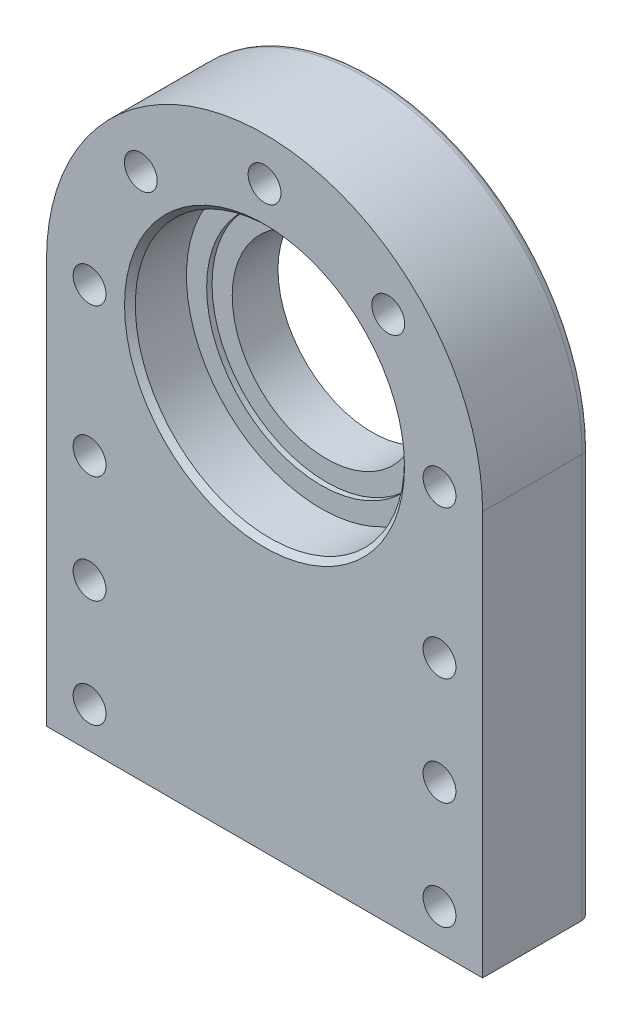
ISO-10303-21;
HEADER;
FILE_DESCRIPTION(('STEP AP214'),'2;1');
FILE_NAME('part.step','',(''),(''),'','','');
FILE_SCHEMA(('AUTOMOTIVE_DESIGN { 1 0 10303 214 1 1 1 1 }'));
ENDSEC;
DATA;
#1=APPLICATION_CONTEXT('core data for automotive mechanical design processes');
#2=APPLICATION_PROTOCOL_DEFINITION('international standard','automotive_design',2000,#1);
#3=PRODUCT_CONTEXT('',#1,'mechanical');
#4=PRODUCT('Part','Part','',(#3));
#5=PRODUCT_RELATED_PRODUCT_CATEGORY('part','',(#4));
#6=PRODUCT_DEFINITION_FORMATION('','',#4);
#7=PRODUCT_DEFINITION_CONTEXT('part definition',#1,'design');
#8=PRODUCT_DEFINITION('design','',#6,#7);
#9=PRODUCT_DEFINITION_SHAPE('','',#8);
#10=(LENGTH_UNIT() NAMED_UNIT(*) SI_UNIT(.MILLI.,.METRE.));
#11=(NAMED_UNIT(*) PLANE_ANGLE_UNIT() SI_UNIT($,.RADIAN.));
#12=(NAMED_UNIT(*) SI_UNIT($,.STERADIAN.) SOLID_ANGLE_UNIT());
#13=UNCERTAINTY_MEASURE_WITH_UNIT(LENGTH_MEASURE(1.E-05),#10,'distance_accuracy_value','');
#14=(GEOMETRIC_REPRESENTATION_CONTEXT(3) GLOBAL_UNCERTAINTY_ASSIGNED_CONTEXT((#13)) GLOBAL_UNIT_ASSIGNED_CONTEXT((#10,
#11,#12)) REPRESENTATION_CONTEXT('',''));
#15=CARTESIAN_POINT('',(0.,0.,0.));
#16=DIRECTION('',(0.,0.,1.));
#17=DIRECTION('',(1.,0.,0.));
#18=AXIS2_PLACEMENT_3D('',#15,#16,#17);
#19=CARTESIAN_POINT('',(0.,0.,40.));
#20=DIRECTION('',(0.,0.,-1.));
#21=DIRECTION('',(-1.,0.,0.));
#22=AXIS2_PLACEMENT_3D('',#19,#20,#21);
#23=CYLINDRICAL_SURFACE('',#22,81.);
#24=DIRECTION('',(0.,0.,-1.));
#25=VECTOR('',#24,1.);
#26=CARTESIAN_POINT('',(81.,0.,40.));
#27=LINE('',#26,#25);
#28=CARTESIAN_POINT('',(81.,0.,40.));
#29=VERTEX_POINT('',#28);
#30=CARTESIAN_POINT('',(81.,0.,3.));
#31=VERTEX_POINT('',#30);
#32=EDGE_CURVE('E283',#29,#31,#27,.T.);
#33=ORIENTED_EDGE('',*,*,#32,.T.);
#34=CARTESIAN_POINT('',(0.,0.,3.));
#35=DIRECTION('',(0.,0.,1.));
#36=DIRECTION('',(1.,0.,0.));
#37=AXIS2_PLACEMENT_3D('',#34,#35,#36);
#38=CIRCLE('',#37,81.);
#39=CARTESIAN_POINT('',(-81.,0.,3.));
#40=VERTEX_POINT('',#39);
#41=EDGE_CURVE('E51',#31,#40,#38,.T.);
#42=ORIENTED_EDGE('',*,*,#41,.T.);
#43=DIRECTION('',(0.,0.,-1.));
#44=VECTOR('',#43,1.);
#45=CARTESIAN_POINT('',(-81.,0.,40.));
#46=LINE('',#45,#44);
#47=CARTESIAN_POINT('',(-81.,0.,40.));
#48=VERTEX_POINT('',#47);
#49=EDGE_CURVE('E99',#48,#40,#46,.T.);
#50=ORIENTED_EDGE('',*,*,#49,.F.);
#51=CARTESIAN_POINT('',(0.,0.,40.));
#52=DIRECTION('',(0.,0.,1.));
#53=DIRECTION('',(1.,0.,0.));
#54=AXIS2_PLACEMENT_3D('',#51,#52,#53);
#55=CIRCLE('',#54,81.);
#56=EDGE_CURVE('E107',#29,#48,#55,.T.);
#57=ORIENTED_EDGE('',*,*,#56,.F.);
#58=EDGE_LOOP('',(#33,#42,#50,#57));
#59=FACE_BOUND('',#58,.T.);
#60=ADVANCED_FACE('F41',(#59),#23,.T.);
#61=CARTESIAN_POINT('',(-81.,0.,40.));
#62=DIRECTION('',(1.,0.,0.));
#63=DIRECTION('',(0.,0.,-1.));
#64=AXIS2_PLACEMENT_3D('',#61,#62,#63);
#65=PLANE('',#64);
#66=ORIENTED_EDGE('',*,*,#49,.T.);
#67=DIRECTION('',(0.,-1.,0.));
#68=VECTOR('',#67,1.);
#69=CARTESIAN_POINT('',(-81.,0.,3.));
#70=LINE('',#69,#68);
#71=CARTESIAN_POINT('',(-81.,-150.,3.));
#72=VERTEX_POINT('',#71);
#73=EDGE_CURVE('E148',#40,#72,#70,.T.);
#74=ORIENTED_EDGE('',*,*,#73,.T.);
#75=DIRECTION('',(0.,0.,-1.));
#76=VECTOR('',#75,1.);
#77=CARTESIAN_POINT('',(-81.,-150.,40.));
#78=LINE('',#77,#76);
#79=CARTESIAN_POINT('',(-81.,-150.,40.));
#80=VERTEX_POINT('',#79);
#81=EDGE_CURVE('E102',#80,#72,#78,.T.);
#82=ORIENTED_EDGE('',*,*,#81,.F.);
#83=DIRECTION('',(0.,-1.,0.));
#84=VECTOR('',#83,1.);
#85=CARTESIAN_POINT('',(-81.,0.,40.));
#86=LINE('',#85,#84);
#87=EDGE_CURVE('E96',#48,#80,#86,.T.);
#88=ORIENTED_EDGE('',*,*,#87,.F.);
#89=EDGE_LOOP('',(#66,#74,#82,#88));
#90=FACE_BOUND('',#89,.T.);
#91=ADVANCED_FACE('F98',(#90),#65,.F.);
#92=CARTESIAN_POINT('',(-81.,-150.,40.));
#93=DIRECTION('',(0.,1.,0.));
#94=DIRECTION('',(0.,0.,1.));
#95=AXIS2_PLACEMENT_3D('',#92,#93,#94);
#96=PLANE('',#95);
#97=ORIENTED_EDGE('',*,*,#81,.T.);
#98=DIRECTION('',(1.,0.,0.));
#99=VECTOR('',#98,1.);
#100=CARTESIAN_POINT('',(-81.,-150.,3.));
#101=LINE('',#100,#99);
#102=CARTESIAN_POINT('',(81.,-150.,3.));
#103=VERTEX_POINT('',#102);
#104=EDGE_CURVE('E131',#72,#103,#101,.T.);
#105=ORIENTED_EDGE('',*,*,#104,.T.);
#106=DIRECTION('',(0.,0.,-1.));
#107=VECTOR('',#106,1.);
#108=CARTESIAN_POINT('',(81.,-150.,40.));
#109=LINE('',#108,#107);
#110=CARTESIAN_POINT('',(81.,-150.,40.));
#111=VERTEX_POINT('',#110);
#112=EDGE_CURVE('E124',#111,#103,#109,.T.);
#113=ORIENTED_EDGE('',*,*,#112,.F.);
#114=DIRECTION('',(1.,0.,0.));
#115=VECTOR('',#114,1.);
#116=CARTESIAN_POINT('',(-81.,-150.,40.));
#117=LINE('',#116,#115);
#118=EDGE_CURVE('E106',#80,#111,#117,.T.);
#119=ORIENTED_EDGE('',*,*,#118,.F.);
#120=EDGE_LOOP('',(#97,#105,#113,#119));
#121=FACE_BOUND('',#120,.T.);
#122=ADVANCED_FACE('F289',(#121),#96,.F.);
#123=CARTESIAN_POINT('',(81.,-150.,40.));
#124=DIRECTION('',(-1.,0.,0.));
#125=DIRECTION('',(0.,0.,1.));
#126=AXIS2_PLACEMENT_3D('',#123,#124,#125);
#127=PLANE('',#126);
#128=ORIENTED_EDGE('',*,*,#112,.T.);
#129=DIRECTION('',(0.,1.,0.));
#130=VECTOR('',#129,1.);
#131=CARTESIAN_POINT('',(81.,-150.,3.));
#132=LINE('',#131,#130);
#133=EDGE_CURVE('E11',#103,#31,#132,.T.);
#134=ORIENTED_EDGE('',*,*,#133,.T.);
#135=ORIENTED_EDGE('',*,*,#32,.F.);
#136=DIRECTION('',(0.,1.,0.));
#137=VECTOR('',#136,1.);
#138=CARTESIAN_POINT('',(81.,-150.,40.));
#139=LINE('',#138,#137);
#140=EDGE_CURVE('E112',#111,#29,#139,.T.);
#141=ORIENTED_EDGE('',*,*,#140,.F.);
#142=EDGE_LOOP('',(#128,#134,#135,#141));
#143=FACE_BOUND('',#142,.T.);
#144=ADVANCED_FACE('F287',(#143),#127,.F.);
#145=CARTESIAN_POINT('',(0.,0.,40.));
#146=DIRECTION('',(0.,0.,1.));
#147=DIRECTION('',(1.,0.,0.));
#148=AXIS2_PLACEMENT_3D('',#145,#146,#147);
#149=PLANE('',#148);
#150=CARTESIAN_POINT('',(0.,0.,40.));
#151=DIRECTION('',(0.,0.,1.));
#152=DIRECTION('',(1.,0.,0.));
#153=AXIS2_PLACEMENT_3D('',#150,#151,#152);
#154=CIRCLE('',#153,52.0000000000001);
#155=CARTESIAN_POINT('',(52.0000000000001,0.,40.));
#156=VERTEX_POINT('',#155);
#157=EDGE_CURVE('E122',#156,#156,#154,.F.);
#158=ORIENTED_EDGE('',*,*,#157,.T.);
#159=EDGE_LOOP('',(#158));
#160=FACE_BOUND('',#159,.T.);
#161=CARTESIAN_POINT('',(65.,-135.,40.));
#162=DIRECTION('',(0.,0.,-1.));
#163=DIRECTION('',(-1.,0.,0.));
#164=AXIS2_PLACEMENT_3D('',#161,#162,#163);
#165=CIRCLE('',#164,6.1);
#166=CARTESIAN_POINT('',(58.9,-135.,40.));
#167=VERTEX_POINT('',#166);
#168=EDGE_CURVE('E198',#167,#167,#165,.T.);
#169=ORIENTED_EDGE('',*,*,#168,.T.);
#170=EDGE_LOOP('',(#169));
#171=FACE_BOUND('',#170,.T.);
#172=CARTESIAN_POINT('',(65.,-95.,40.));
#173=DIRECTION('',(0.,0.,-1.));
#174=DIRECTION('',(-1.,0.,0.));
#175=AXIS2_PLACEMENT_3D('',#172,#173,#174);
#176=CIRCLE('',#175,6.1);
#177=CARTESIAN_POINT('',(58.9,-95.,40.));
#178=VERTEX_POINT('',#177);
#179=EDGE_CURVE('E206',#178,#178,#176,.T.);
#180=ORIENTED_EDGE('',*,*,#179,.T.);
#181=EDGE_LOOP('',(#180));
#182=FACE_BOUND('',#181,.T.);
#183=CARTESIAN_POINT('',(65.,-55.,40.));
#184=DIRECTION('',(0.,0.,-1.));
#185=DIRECTION('',(-1.,0.,0.));
#186=AXIS2_PLACEMENT_3D('',#183,#184,#185);
#187=CIRCLE('',#186,6.1);
#188=CARTESIAN_POINT('',(58.9,-55.,40.));
#189=VERTEX_POINT('',#188);
#190=EDGE_CURVE('E192',#189,#189,#187,.T.);
#191=ORIENTED_EDGE('',*,*,#190,.T.);
#192=EDGE_LOOP('',(#191));
#193=FACE_BOUND('',#192,.T.);
#194=CARTESIAN_POINT('',(-65.,-135.,40.));
#195=DIRECTION('',(0.,0.,1.));
#196=DIRECTION('',(1.,0.,0.));
#197=AXIS2_PLACEMENT_3D('',#194,#195,#196);
#198=CIRCLE('',#197,6.1);
#199=CARTESIAN_POINT('',(-58.9,-135.,40.));
#200=VERTEX_POINT('',#199);
#201=EDGE_CURVE('E222',#200,#200,#198,.T.);
#202=ORIENTED_EDGE('',*,*,#201,.F.);
#203=EDGE_LOOP('',(#202));
#204=FACE_BOUND('',#203,.T.);
#205=CARTESIAN_POINT('',(-65.,-95.,40.));
#206=DIRECTION('',(0.,0.,1.));
#207=DIRECTION('',(1.,0.,0.));
#208=AXIS2_PLACEMENT_3D('',#205,#206,#207);
#209=CIRCLE('',#208,6.1);
#210=CARTESIAN_POINT('',(-58.9,-95.,40.));
#211=VERTEX_POINT('',#210);
#212=EDGE_CURVE('E230',#211,#211,#209,.T.);
#213=ORIENTED_EDGE('',*,*,#212,.F.);
#214=EDGE_LOOP('',(#213));
#215=FACE_BOUND('',#214,.T.);
#216=CARTESIAN_POINT('',(-65.,-55.,40.));
#217=DIRECTION('',(0.,0.,1.));
#218=DIRECTION('',(1.,0.,0.));
#219=AXIS2_PLACEMENT_3D('',#216,#217,#218);
#220=CIRCLE('',#219,6.1);
#221=CARTESIAN_POINT('',(-58.9,-55.,40.));
#222=VERTEX_POINT('',#221);
#223=EDGE_CURVE('E197',#222,#222,#220,.T.);
#224=ORIENTED_EDGE('',*,*,#223,.F.);
#225=EDGE_LOOP('',(#224));
#226=FACE_BOUND('',#225,.T.);
#227=CARTESIAN_POINT('',(-45.9619407771255,45.9619407771257,40.));
#228=DIRECTION('',(0.,0.,1.));
#229=DIRECTION('',(0.707106781186546,-0.707106781186549,0.));
#230=AXIS2_PLACEMENT_3D('',#227,#228,#229);
#231=CIRCLE('',#230,6.1);
#232=CARTESIAN_POINT('',(-41.6485894118876,41.6485894118877,40.));
#233=VERTEX_POINT('',#232);
#234=EDGE_CURVE('E246',#233,#233,#231,.T.);
#235=ORIENTED_EDGE('',*,*,#234,.F.);
#236=EDGE_LOOP('',(#235));
#237=FACE_BOUND('',#236,.T.);
#238=CARTESIAN_POINT('',(2.26946287024804E-13,65.,40.));
#239=DIRECTION('',(0.,0.,1.));
#240=DIRECTION('',(0.,-1.,0.));
#241=AXIS2_PLACEMENT_3D('',#238,#239,#240);
#242=CIRCLE('',#241,6.1);
#243=CARTESIAN_POINT('',(2.05648250857861E-13,58.9,40.));
#244=VERTEX_POINT('',#243);
#245=EDGE_CURVE('E254',#244,#244,#242,.T.);
#246=ORIENTED_EDGE('',*,*,#245,.F.);
#247=EDGE_LOOP('',(#246));
#248=FACE_BOUND('',#247,.T.);
#249=CARTESIAN_POINT('',(45.9619407771258,45.9619407771253,40.));
#250=DIRECTION('',(0.,0.,1.));
#251=DIRECTION('',(-0.707106781186551,-0.707106781186544,0.));
#252=AXIS2_PLACEMENT_3D('',#249,#250,#251);
#253=CIRCLE('',#252,6.1);
#254=CARTESIAN_POINT('',(41.6485894118879,41.6485894118874,40.));
#255=VERTEX_POINT('',#254);
#256=EDGE_CURVE('E262',#255,#255,#253,.T.);
#257=ORIENTED_EDGE('',*,*,#256,.F.);
#258=EDGE_LOOP('',(#257));
#259=FACE_BOUND('',#258,.T.);
#260=CARTESIAN_POINT('',(65.,0.,40.));
#261=DIRECTION('',(0.,0.,1.));
#262=DIRECTION('',(-1.,0.,0.));
#263=AXIS2_PLACEMENT_3D('',#260,#261,#262);
#264=CIRCLE('',#263,6.1);
#265=CARTESIAN_POINT('',(58.9,0.,40.));
#266=VERTEX_POINT('',#265);
#267=EDGE_CURVE('E221',#266,#266,#264,.T.);
#268=ORIENTED_EDGE('',*,*,#267,.F.);
#269=EDGE_LOOP('',(#268));
#270=FACE_BOUND('',#269,.T.);
#271=CARTESIAN_POINT('',(-65.,0.,40.));
#272=DIRECTION('',(0.,0.,1.));
#273=DIRECTION('',(1.,0.,0.));
#274=AXIS2_PLACEMENT_3D('',#271,#272,#273);
#275=CIRCLE('',#274,6.1);
#276=CARTESIAN_POINT('',(-58.9,0.,40.));
#277=VERTEX_POINT('',#276);
#278=EDGE_CURVE('E245',#277,#277,#275,.T.);
#279=ORIENTED_EDGE('',*,*,#278,.F.);
#280=EDGE_LOOP('',(#279));
#281=FACE_BOUND('',#280,.T.);
#282=ORIENTED_EDGE('',*,*,#56,.T.);
#283=ORIENTED_EDGE('',*,*,#87,.T.);
#284=ORIENTED_EDGE('',*,*,#118,.T.);
#285=ORIENTED_EDGE('',*,*,#140,.T.);
#286=EDGE_LOOP('',(#282,#283,#284,#285));
#287=FACE_BOUND('',#286,.T.);
#288=ADVANCED_FACE('F110',(#160,#171,#182,#193,#204,#215,#226,#237,#248,#259,#270,#281,#287),
#149,.T.);
#289=CARTESIAN_POINT('',(0.,0.,0.));
#290=DIRECTION('',(0.,0.,1.));
#291=DIRECTION('',(1.,0.,0.));
#292=AXIS2_PLACEMENT_3D('',#289,#290,#291);
#293=PLANE('',#292);
#294=DIRECTION('',(0.,1.,0.));
#295=VECTOR('',#294,1.);
#296=CARTESIAN_POINT('',(78.,0.,0.));
#297=LINE('',#296,#295);
#298=CARTESIAN_POINT('',(78.,0.,0.));
#299=VERTEX_POINT('',#298);
#300=CARTESIAN_POINT('',(78.,-147.,0.));
#301=VERTEX_POINT('',#300);
#302=EDGE_CURVE('E135',#299,#301,#297,.F.);
#303=ORIENTED_EDGE('',*,*,#302,.T.);
#304=DIRECTION('',(1.,0.,0.));
#305=VECTOR('',#304,1.);
#306=CARTESIAN_POINT('',(0.,-147.,0.));
#307=LINE('',#306,#305);
#308=CARTESIAN_POINT('',(-78.,-147.,0.));
#309=VERTEX_POINT('',#308);
#310=EDGE_CURVE('E144',#301,#309,#307,.F.);
#311=ORIENTED_EDGE('',*,*,#310,.T.);
#312=DIRECTION('',(0.,-1.,0.));
#313=VECTOR('',#312,1.);
#314=CARTESIAN_POINT('',(-78.,0.,0.));
#315=LINE('',#314,#313);
#316=CARTESIAN_POINT('',(-78.,0.,0.));
#317=VERTEX_POINT('',#316);
#318=EDGE_CURVE('E141',#309,#317,#315,.F.);
#319=ORIENTED_EDGE('',*,*,#318,.T.);
#320=CARTESIAN_POINT('',(0.,0.,0.));
#321=DIRECTION('',(0.,0.,1.));
#322=DIRECTION('',(1.,0.,0.));
#323=AXIS2_PLACEMENT_3D('',#320,#321,#322);
#324=CIRCLE('',#323,78.);
#325=EDGE_CURVE('E138',#317,#299,#324,.F.);
#326=ORIENTED_EDGE('',*,*,#325,.T.);
#327=EDGE_LOOP('',(#303,#311,#319,#326));
#328=FACE_BOUND('',#327,.T.);
#329=CARTESIAN_POINT('',(0.,0.,0.));
#330=DIRECTION('',(0.,0.,1.));
#331=DIRECTION('',(1.,0.,0.));
#332=AXIS2_PLACEMENT_3D('',#329,#330,#331);
#333=CIRCLE('',#332,35.);
#334=CARTESIAN_POINT('',(35.,0.,0.));
#335=VERTEX_POINT('',#334);
#336=EDGE_CURVE('E172',#335,#335,#333,.T.);
#337=ORIENTED_EDGE('',*,*,#336,.T.);
#338=EDGE_LOOP('',(#337));
#339=FACE_BOUND('',#338,.T.);
#340=CARTESIAN_POINT('',(65.,-135.,0.));
#341=DIRECTION('',(0.,0.,-1.));
#342=DIRECTION('',(-1.,0.,0.));
#343=AXIS2_PLACEMENT_3D('',#340,#341,#342);
#344=CIRCLE('',#343,6.1);
#345=CARTESIAN_POINT('',(58.9,-135.,0.));
#346=VERTEX_POINT('',#345);
#347=EDGE_CURVE('E193',#346,#346,#344,.T.);
#348=ORIENTED_EDGE('',*,*,#347,.F.);
#349=EDGE_LOOP('',(#348));
#350=FACE_BOUND('',#349,.T.);
#351=CARTESIAN_POINT('',(65.,-95.,0.));
#352=DIRECTION('',(0.,0.,-1.));
#353=DIRECTION('',(-1.,0.,0.));
#354=AXIS2_PLACEMENT_3D('',#351,#352,#353);
#355=CIRCLE('',#354,6.1);
#356=CARTESIAN_POINT('',(58.9,-95.,0.));
#357=VERTEX_POINT('',#356);
#358=EDGE_CURVE('E202',#357,#357,#355,.T.);
#359=ORIENTED_EDGE('',*,*,#358,.F.);
#360=EDGE_LOOP('',(#359));
#361=FACE_BOUND('',#360,.T.);
#362=CARTESIAN_POINT('',(65.,-55.,0.));
#363=DIRECTION('',(0.,0.,-1.));
#364=DIRECTION('',(-1.,0.,0.));
#365=AXIS2_PLACEMENT_3D('',#362,#363,#364);
#366=CIRCLE('',#365,6.1);
#367=CARTESIAN_POINT('',(58.9,-55.,0.));
#368=VERTEX_POINT('',#367);
#369=EDGE_CURVE('E210',#368,#368,#366,.T.);
#370=ORIENTED_EDGE('',*,*,#369,.F.);
#371=EDGE_LOOP('',(#370));
#372=FACE_BOUND('',#371,.T.);
#373=CARTESIAN_POINT('',(-65.,-135.,0.));
#374=DIRECTION('',(0.,0.,1.));
#375=DIRECTION('',(1.,0.,0.));
#376=AXIS2_PLACEMENT_3D('',#373,#374,#375);
#377=CIRCLE('',#376,6.1);
#378=CARTESIAN_POINT('',(-58.9,-135.,0.));
#379=VERTEX_POINT('',#378);
#380=EDGE_CURVE('E217',#379,#379,#377,.T.);
#381=ORIENTED_EDGE('',*,*,#380,.T.);
#382=EDGE_LOOP('',(#381));
#383=FACE_BOUND('',#382,.T.);
#384=CARTESIAN_POINT('',(-65.,-95.,0.));
#385=DIRECTION('',(0.,0.,1.));
#386=DIRECTION('',(1.,0.,0.));
#387=AXIS2_PLACEMENT_3D('',#384,#385,#386);
#388=CIRCLE('',#387,6.1);
#389=CARTESIAN_POINT('',(-58.9,-95.,0.));
#390=VERTEX_POINT('',#389);
#391=EDGE_CURVE('E226',#390,#390,#388,.T.);
#392=ORIENTED_EDGE('',*,*,#391,.T.);
#393=EDGE_LOOP('',(#392));
#394=FACE_BOUND('',#393,.T.);
#395=CARTESIAN_POINT('',(-65.,-55.,0.));
#396=DIRECTION('',(0.,0.,1.));
#397=DIRECTION('',(1.,0.,0.));
#398=AXIS2_PLACEMENT_3D('',#395,#396,#397);
#399=CIRCLE('',#398,6.1);
#400=CARTESIAN_POINT('',(-58.9,-55.,0.));
#401=VERTEX_POINT('',#400);
#402=EDGE_CURVE('E234',#401,#401,#399,.T.);
#403=ORIENTED_EDGE('',*,*,#402,.T.);
#404=EDGE_LOOP('',(#403));
#405=FACE_BOUND('',#404,.T.);
#406=CARTESIAN_POINT('',(-45.9619407771255,45.9619407771257,0.));
#407=DIRECTION('',(0.,0.,1.));
#408=DIRECTION('',(0.707106781186546,-0.707106781186549,0.));
#409=AXIS2_PLACEMENT_3D('',#406,#407,#408);
#410=CIRCLE('',#409,6.1);
#411=CARTESIAN_POINT('',(-41.6485894118876,41.6485894118877,0.));
#412=VERTEX_POINT('',#411);
#413=EDGE_CURVE('E241',#412,#412,#410,.T.);
#414=ORIENTED_EDGE('',*,*,#413,.T.);
#415=EDGE_LOOP('',(#414));
#416=FACE_BOUND('',#415,.T.);
#417=CARTESIAN_POINT('',(2.26946287024804E-13,65.,0.));
#418=DIRECTION('',(0.,0.,1.));
#419=DIRECTION('',(0.,-1.,0.));
#420=AXIS2_PLACEMENT_3D('',#417,#418,#419);
#421=CIRCLE('',#420,6.1);
#422=CARTESIAN_POINT('',(2.05648250857861E-13,58.9,0.));
#423=VERTEX_POINT('',#422);
#424=EDGE_CURVE('E250',#423,#423,#421,.T.);
#425=ORIENTED_EDGE('',*,*,#424,.T.);
#426=EDGE_LOOP('',(#425));
#427=FACE_BOUND('',#426,.T.);
#428=CARTESIAN_POINT('',(45.9619407771258,45.9619407771253,0.));
#429=DIRECTION('',(0.,0.,1.));
#430=DIRECTION('',(-0.707106781186551,-0.707106781186544,0.));
#431=AXIS2_PLACEMENT_3D('',#428,#429,#430);
#432=CIRCLE('',#431,6.1);
#433=CARTESIAN_POINT('',(41.6485894118879,41.6485894118874,0.));
#434=VERTEX_POINT('',#433);
#435=EDGE_CURVE('E258',#434,#434,#432,.T.);
#436=ORIENTED_EDGE('',*,*,#435,.T.);
#437=EDGE_LOOP('',(#436));
#438=FACE_BOUND('',#437,.T.);
#439=CARTESIAN_POINT('',(65.,0.,0.));
#440=DIRECTION('',(0.,0.,1.));
#441=DIRECTION('',(-1.,0.,0.));
#442=AXIS2_PLACEMENT_3D('',#439,#440,#441);
#443=CIRCLE('',#442,6.1);
#444=CARTESIAN_POINT('',(58.9,0.,0.));
#445=VERTEX_POINT('',#444);
#446=EDGE_CURVE('E266',#445,#445,#443,.T.);
#447=ORIENTED_EDGE('',*,*,#446,.T.);
#448=EDGE_LOOP('',(#447));
#449=FACE_BOUND('',#448,.T.);
#450=CARTESIAN_POINT('',(-65.,0.,0.));
#451=DIRECTION('',(0.,0.,1.));
#452=DIRECTION('',(1.,0.,0.));
#453=AXIS2_PLACEMENT_3D('',#450,#451,#452);
#454=CIRCLE('',#453,6.1);
#455=CARTESIAN_POINT('',(-58.9,0.,0.));
#456=VERTEX_POINT('',#455);
#457=EDGE_CURVE('E114',#456,#456,#454,.T.);
#458=ORIENTED_EDGE('',*,*,#457,.T.);
#459=EDGE_LOOP('',(#458));
#460=FACE_BOUND('',#459,.T.);
#461=ADVANCED_FACE('F394',(#328,#339,#350,#361,#372,#383,#394,#405,#416,#427,#438,#449,#460),
#293,.F.);
#462=CARTESIAN_POINT('',(-65.,0.,0.));
#463=DIRECTION('',(0.,0.,1.));
#464=DIRECTION('',(1.,0.,0.));
#465=AXIS2_PLACEMENT_3D('',#462,#463,#464);
#466=CYLINDRICAL_SURFACE('',#465,6.1);
#467=ORIENTED_EDGE('',*,*,#457,.F.);
#468=EDGE_LOOP('',(#467));
#469=FACE_BOUND('',#468,.T.);
#470=ORIENTED_EDGE('',*,*,#278,.T.);
#471=EDGE_LOOP('',(#470));
#472=FACE_BOUND('',#471,.T.);
#473=ADVANCED_FACE('F390',(#469,#472),#466,.F.);
#474=CARTESIAN_POINT('',(65.,0.,0.));
#475=DIRECTION('',(0.,0.,1.));
#476=DIRECTION('',(1.,0.,0.));
#477=AXIS2_PLACEMENT_3D('',#474,#475,#476);
#478=CYLINDRICAL_SURFACE('',#477,6.1);
#479=ORIENTED_EDGE('',*,*,#446,.F.);
#480=EDGE_LOOP('',(#479));
#481=FACE_BOUND('',#480,.T.);
#482=ORIENTED_EDGE('',*,*,#267,.T.);
#483=EDGE_LOOP('',(#482));
#484=FACE_BOUND('',#483,.T.);
#485=ADVANCED_FACE('F386',(#481,#484),#478,.F.);
#486=CARTESIAN_POINT('',(45.9619407771258,45.9619407771253,0.));
#487=DIRECTION('',(0.,0.,1.));
#488=DIRECTION('',(1.,0.,0.));
#489=AXIS2_PLACEMENT_3D('',#486,#487,#488);
#490=CYLINDRICAL_SURFACE('',#489,6.1);
#491=ORIENTED_EDGE('',*,*,#435,.F.);
#492=EDGE_LOOP('',(#491));
#493=FACE_BOUND('',#492,.T.);
#494=ORIENTED_EDGE('',*,*,#256,.T.);
#495=EDGE_LOOP('',(#494));
#496=FACE_BOUND('',#495,.T.);
#497=ADVANCED_FACE('F382',(#493,#496),#490,.F.);
#498=CARTESIAN_POINT('',(2.26946287024804E-13,65.,0.));
#499=DIRECTION('',(0.,0.,1.));
#500=DIRECTION('',(1.,0.,0.));
#501=AXIS2_PLACEMENT_3D('',#498,#499,#500);
#502=CYLINDRICAL_SURFACE('',#501,6.1);
#503=ORIENTED_EDGE('',*,*,#424,.F.);
#504=EDGE_LOOP('',(#503));
#505=FACE_BOUND('',#504,.T.);
#506=ORIENTED_EDGE('',*,*,#245,.T.);
#507=EDGE_LOOP('',(#506));
#508=FACE_BOUND('',#507,.T.);
#509=ADVANCED_FACE('F378',(#505,#508),#502,.F.);
#510=CARTESIAN_POINT('',(-45.9619407771255,45.9619407771257,0.));
#511=DIRECTION('',(0.,0.,1.));
#512=DIRECTION('',(1.,0.,0.));
#513=AXIS2_PLACEMENT_3D('',#510,#511,#512);
#514=CYLINDRICAL_SURFACE('',#513,6.1);
#515=ORIENTED_EDGE('',*,*,#413,.F.);
#516=EDGE_LOOP('',(#515));
#517=FACE_BOUND('',#516,.T.);
#518=ORIENTED_EDGE('',*,*,#234,.T.);
#519=EDGE_LOOP('',(#518));
#520=FACE_BOUND('',#519,.T.);
#521=ADVANCED_FACE('F374',(#517,#520),#514,.F.);
#522=CARTESIAN_POINT('',(-65.,-55.,0.));
#523=DIRECTION('',(0.,0.,1.));
#524=DIRECTION('',(1.,0.,0.));
#525=AXIS2_PLACEMENT_3D('',#522,#523,#524);
#526=CYLINDRICAL_SURFACE('',#525,6.1);
#527=ORIENTED_EDGE('',*,*,#402,.F.);
#528=EDGE_LOOP('',(#527));
#529=FACE_BOUND('',#528,.T.);
#530=ORIENTED_EDGE('',*,*,#223,.T.);
#531=EDGE_LOOP('',(#530));
#532=FACE_BOUND('',#531,.T.);
#533=ADVANCED_FACE('F370',(#529,#532),#526,.F.);
#534=CARTESIAN_POINT('',(-65.,-95.,0.));
#535=DIRECTION('',(0.,0.,1.));
#536=DIRECTION('',(1.,0.,0.));
#537=AXIS2_PLACEMENT_3D('',#534,#535,#536);
#538=CYLINDRICAL_SURFACE('',#537,6.1);
#539=ORIENTED_EDGE('',*,*,#391,.F.);
#540=EDGE_LOOP('',(#539));
#541=FACE_BOUND('',#540,.T.);
#542=ORIENTED_EDGE('',*,*,#212,.T.);
#543=EDGE_LOOP('',(#542));
#544=FACE_BOUND('',#543,.T.);
#545=ADVANCED_FACE('F366',(#541,#544),#538,.F.);
#546=CARTESIAN_POINT('',(-65.,-135.,0.));
#547=DIRECTION('',(0.,0.,1.));
#548=DIRECTION('',(1.,0.,0.));
#549=AXIS2_PLACEMENT_3D('',#546,#547,#548);
#550=CYLINDRICAL_SURFACE('',#549,6.1);
#551=ORIENTED_EDGE('',*,*,#380,.F.);
#552=EDGE_LOOP('',(#551));
#553=FACE_BOUND('',#552,.T.);
#554=ORIENTED_EDGE('',*,*,#201,.T.);
#555=EDGE_LOOP('',(#554));
#556=FACE_BOUND('',#555,.T.);
#557=ADVANCED_FACE('F362',(#553,#556),#550,.F.);
#558=CARTESIAN_POINT('',(65.,-55.,0.));
#559=DIRECTION('',(0.,0.,1.));
#560=DIRECTION('',(1.,0.,0.));
#561=AXIS2_PLACEMENT_3D('',#558,#559,#560);
#562=CYLINDRICAL_SURFACE('',#561,6.1);
#563=ORIENTED_EDGE('',*,*,#369,.T.);
#564=EDGE_LOOP('',(#563));
#565=FACE_BOUND('',#564,.T.);
#566=ORIENTED_EDGE('',*,*,#190,.F.);
#567=EDGE_LOOP('',(#566));
#568=FACE_BOUND('',#567,.T.);
#569=ADVANCED_FACE('F358',(#565,#568),#562,.F.);
#570=CARTESIAN_POINT('',(65.,-95.,0.));
#571=DIRECTION('',(0.,0.,1.));
#572=DIRECTION('',(1.,0.,0.));
#573=AXIS2_PLACEMENT_3D('',#570,#571,#572);
#574=CYLINDRICAL_SURFACE('',#573,6.1);
#575=ORIENTED_EDGE('',*,*,#358,.T.);
#576=EDGE_LOOP('',(#575));
#577=FACE_BOUND('',#576,.T.);
#578=ORIENTED_EDGE('',*,*,#179,.F.);
#579=EDGE_LOOP('',(#578));
#580=FACE_BOUND('',#579,.T.);
#581=ADVANCED_FACE('F354',(#577,#580),#574,.F.);
#582=CARTESIAN_POINT('',(65.,-135.,0.));
#583=DIRECTION('',(0.,0.,1.));
#584=DIRECTION('',(1.,0.,0.));
#585=AXIS2_PLACEMENT_3D('',#582,#583,#584);
#586=CYLINDRICAL_SURFACE('',#585,6.1);
#587=ORIENTED_EDGE('',*,*,#347,.T.);
#588=EDGE_LOOP('',(#587));
#589=FACE_BOUND('',#588,.T.);
#590=ORIENTED_EDGE('',*,*,#168,.F.);
#591=EDGE_LOOP('',(#590));
#592=FACE_BOUND('',#591,.T.);
#593=ADVANCED_FACE('F336',(#589,#592),#586,.F.);
#594=CARTESIAN_POINT('',(0.,0.,19.));
#595=DIRECTION('',(0.,0.,1.));
#596=DIRECTION('',(1.,0.,0.));
#597=AXIS2_PLACEMENT_3D('',#594,#595,#596);
#598=CYLINDRICAL_SURFACE('',#597,50.);
#599=CARTESIAN_POINT('',(0.,0.,37.9999999999999));
#600=DIRECTION('',(0.,0.,1.));
#601=DIRECTION('',(1.,0.,0.));
#602=AXIS2_PLACEMENT_3D('',#599,#600,#601);
#603=CIRCLE('',#602,50.);
#604=CARTESIAN_POINT('',(50.,0.,37.9999999999999));
#605=VERTEX_POINT('',#604);
#606=EDGE_CURVE('E117',#605,#605,#603,.T.);
#607=ORIENTED_EDGE('',*,*,#606,.T.);
#608=EDGE_LOOP('',(#607));
#609=FACE_BOUND('',#608,.T.);
#610=CARTESIAN_POINT('',(0.,0.,19.));
#611=DIRECTION('',(0.,0.,1.));
#612=DIRECTION('',(1.,0.,0.));
#613=AXIS2_PLACEMENT_3D('',#610,#611,#612);
#614=CIRCLE('',#613,50.);
#615=CARTESIAN_POINT('',(50.,0.,19.));
#616=VERTEX_POINT('',#615);
#617=EDGE_CURVE('E185',#616,#616,#614,.T.);
#618=ORIENTED_EDGE('',*,*,#617,.F.);
#619=EDGE_LOOP('',(#618));
#620=FACE_BOUND('',#619,.T.);
#621=ADVANCED_FACE('F332',(#609,#620),#598,.F.);
#622=CARTESIAN_POINT('',(0.,0.,19.));
#623=DIRECTION('',(0.,0.,1.));
#624=DIRECTION('',(1.,0.,0.));
#625=AXIS2_PLACEMENT_3D('',#622,#623,#624);
#626=PLANE('',#625);
#627=CARTESIAN_POINT('',(0.,0.,19.));
#628=DIRECTION('',(0.,0.,1.));
#629=DIRECTION('',(1.,0.,0.));
#630=AXIS2_PLACEMENT_3D('',#627,#628,#629);
#631=CIRCLE('',#630,42.5);
#632=CARTESIAN_POINT('',(42.5,0.,19.));
#633=VERTEX_POINT('',#632);
#634=EDGE_CURVE('E178',#633,#633,#631,.T.);
#635=ORIENTED_EDGE('',*,*,#634,.F.);
#636=EDGE_LOOP('',(#635));
#637=FACE_BOUND('',#636,.T.);
#638=ORIENTED_EDGE('',*,*,#617,.T.);
#639=EDGE_LOOP('',(#638));
#640=FACE_BOUND('',#639,.T.);
#641=ADVANCED_FACE('F335',(#637,#640),#626,.T.);
#642=CARTESIAN_POINT('',(0.,0.,17.));
#643=DIRECTION('',(0.,0.,1.));
#644=DIRECTION('',(1.,0.,0.));
#645=AXIS2_PLACEMENT_3D('',#642,#643,#644);
#646=CYLINDRICAL_SURFACE('',#645,42.5);
#647=CARTESIAN_POINT('',(0.,0.,17.));
#648=DIRECTION('',(0.,0.,1.));
#649=DIRECTION('',(1.,0.,0.));
#650=AXIS2_PLACEMENT_3D('',#647,#648,#649);
#651=CIRCLE('',#650,42.5);
#652=CARTESIAN_POINT('',(42.5,0.,17.));
#653=VERTEX_POINT('',#652);
#654=EDGE_CURVE('E181',#653,#653,#651,.T.);
#655=ORIENTED_EDGE('',*,*,#654,.F.);
#656=EDGE_LOOP('',(#655));
#657=FACE_BOUND('',#656,.T.);
#658=ORIENTED_EDGE('',*,*,#634,.T.);
#659=EDGE_LOOP('',(#658));
#660=FACE_BOUND('',#659,.T.);
#661=ADVANCED_FACE('F341',(#657,#660),#646,.F.);
#662=CARTESIAN_POINT('',(0.,0.,17.));
#663=DIRECTION('',(0.,0.,1.));
#664=DIRECTION('',(1.,0.,0.));
#665=AXIS2_PLACEMENT_3D('',#662,#663,#664);
#666=PLANE('',#665);
#667=CARTESIAN_POINT('',(0.,0.,17.));
#668=DIRECTION('',(0.,0.,1.));
#669=DIRECTION('',(1.,0.,0.));
#670=AXIS2_PLACEMENT_3D('',#667,#668,#669);
#671=CIRCLE('',#670,35.);
#672=CARTESIAN_POINT('',(35.,0.,17.));
#673=VERTEX_POINT('',#672);
#674=EDGE_CURVE('E166',#673,#673,#671,.T.);
#675=ORIENTED_EDGE('',*,*,#674,.F.);
#676=EDGE_LOOP('',(#675));
#677=FACE_BOUND('',#676,.T.);
#678=ORIENTED_EDGE('',*,*,#654,.T.);
#679=EDGE_LOOP('',(#678));
#680=FACE_BOUND('',#679,.T.);
#681=ADVANCED_FACE('F325',(#677,#680),#666,.T.);
#682=CARTESIAN_POINT('',(0.,0.,0.));
#683=DIRECTION('',(0.,0.,1.));
#684=DIRECTION('',(1.,0.,0.));
#685=AXIS2_PLACEMENT_3D('',#682,#683,#684);
#686=CYLINDRICAL_SURFACE('',#685,35.);
#687=ORIENTED_EDGE('',*,*,#336,.F.);
#688=EDGE_LOOP('',(#687));
#689=FACE_BOUND('',#688,.T.);
#690=ORIENTED_EDGE('',*,*,#674,.T.);
#691=EDGE_LOOP('',(#690));
#692=FACE_BOUND('',#691,.T.);
#693=ADVANCED_FACE('F318',(#689,#692),#686,.F.);
#694=CARTESIAN_POINT('',(0.,0.,37.9999999999999));
#695=DIRECTION('',(0.,0.,1.));
#696=DIRECTION('',(1.,0.,0.));
#697=AXIS2_PLACEMENT_3D('',#694,#695,#696);
#698=CONICAL_SURFACE('',#697,50.,0.785398163397448);
#699=ORIENTED_EDGE('',*,*,#157,.F.);
#700=EDGE_LOOP('',(#699));
#701=FACE_BOUND('',#700,.T.);
#702=ORIENTED_EDGE('',*,*,#606,.F.);
#703=EDGE_LOOP('',(#702));
#704=FACE_BOUND('',#703,.T.);
#705=ADVANCED_FACE('F314',(#701,#704),#698,.F.);
#706=CARTESIAN_POINT('',(0.,0.,3.));
#707=DIRECTION('',(0.,0.,1.));
#708=DIRECTION('',(1.,0.,0.));
#709=AXIS2_PLACEMENT_3D('',#706,#707,#708);
#710=TOROIDAL_SURFACE('',#709,78.,3.);
#711=CARTESIAN_POINT('',(78.,0.,3.));
#712=DIRECTION('',(0.,-1.,0.));
#713=DIRECTION('',(0.,0.,-1.));
#714=AXIS2_PLACEMENT_3D('',#711,#712,#713);
#715=CIRCLE('',#714,3.);
#716=EDGE_CURVE('E158',#299,#31,#715,.T.);
#717=ORIENTED_EDGE('',*,*,#716,.F.);
#718=ORIENTED_EDGE('',*,*,#325,.F.);
#719=CARTESIAN_POINT('',(-78.,0.,3.));
#720=DIRECTION('',(0.,-1.,0.));
#721=DIRECTION('',(0.,0.,-1.));
#722=AXIS2_PLACEMENT_3D('',#719,#720,#721);
#723=CIRCLE('',#722,3.);
#724=EDGE_CURVE('E45',#40,#317,#723,.T.);
#725=ORIENTED_EDGE('',*,*,#724,.F.);
#726=ORIENTED_EDGE('',*,*,#41,.F.);
#727=EDGE_LOOP('',(#717,#718,#725,#726));
#728=FACE_BOUND('',#727,.T.);
#729=ADVANCED_FACE('F43',(#728),#710,.T.);
#730=CARTESIAN_POINT('',(-78.,0.,3.));
#731=DIRECTION('',(0.,-1.,0.));
#732=DIRECTION('',(0.,0.,-1.));
#733=AXIS2_PLACEMENT_3D('',#730,#731,#732);
#734=CYLINDRICAL_SURFACE('',#733,3.);
#735=ORIENTED_EDGE('',*,*,#724,.T.);
#736=ORIENTED_EDGE('',*,*,#318,.F.);
#737=CARTESIAN_POINT('',(-78.,-147.,3.));
#738=DIRECTION('',(0.707106781186547,-0.707106781186547,0.));
#739=DIRECTION('',(-0.707106781186547,-0.707106781186547,0.));
#740=AXIS2_PLACEMENT_3D('',#737,#738,#739);
#741=ELLIPSE('',#740,4.24264068711928,3.);
#742=EDGE_CURVE('E156',#72,#309,#741,.T.);
#743=ORIENTED_EDGE('',*,*,#742,.F.);
#744=ORIENTED_EDGE('',*,*,#73,.F.);
#745=EDGE_LOOP('',(#735,#736,#743,#744));
#746=FACE_BOUND('',#745,.T.);
#747=ADVANCED_FACE('F298',(#746),#734,.T.);
#748=CARTESIAN_POINT('',(78.,-150.,3.));
#749=DIRECTION('',(0.,1.,0.));
#750=DIRECTION('',(0.,0.,1.));
#751=AXIS2_PLACEMENT_3D('',#748,#749,#750);
#752=CYLINDRICAL_SURFACE('',#751,3.);
#753=ORIENTED_EDGE('',*,*,#716,.T.);
#754=ORIENTED_EDGE('',*,*,#133,.F.);
#755=CARTESIAN_POINT('',(78.,-147.,3.));
#756=DIRECTION('',(0.707106781186547,0.707106781186547,0.));
#757=DIRECTION('',(-0.707106781186547,0.707106781186547,0.));
#758=AXIS2_PLACEMENT_3D('',#755,#756,#757);
#759=ELLIPSE('',#758,4.24264068711928,3.);
#760=EDGE_CURVE('E153',#301,#103,#759,.F.);
#761=ORIENTED_EDGE('',*,*,#760,.F.);
#762=ORIENTED_EDGE('',*,*,#302,.F.);
#763=EDGE_LOOP('',(#753,#754,#761,#762));
#764=FACE_BOUND('',#763,.T.);
#765=ADVANCED_FACE('F296',(#764),#752,.T.);
#766=CARTESIAN_POINT('',(-81.,-147.,3.));
#767=DIRECTION('',(1.,0.,0.));
#768=DIRECTION('',(0.,0.,-1.));
#769=AXIS2_PLACEMENT_3D('',#766,#767,#768);
#770=CYLINDRICAL_SURFACE('',#769,3.);
#771=ORIENTED_EDGE('',*,*,#742,.T.);
#772=ORIENTED_EDGE('',*,*,#310,.F.);
#773=ORIENTED_EDGE('',*,*,#760,.T.);
#774=ORIENTED_EDGE('',*,*,#104,.F.);
#775=EDGE_LOOP('',(#771,#772,#773,#774));
#776=FACE_BOUND('',#775,.T.);
#777=ADVANCED_FACE('F293',(#776),#770,.T.);
#778=CLOSED_SHELL('',(#60,#91,#122,#144,#288,#461,#473,#485,#497,#509,#521,#533,#545,#557,#569,
#581,#593,#621,#641,#661,#681,#693,#705,#729,#747,#765,#777));
#779=MANIFOLD_SOLID_BREP('B2',#778);
#780=ADVANCED_BREP_SHAPE_REPRESENTATION('',(#18,#779),#14);
#781=SHAPE_DEFINITION_REPRESENTATION(#9,#780);
ENDSEC;
END-ISO-10303-21;
